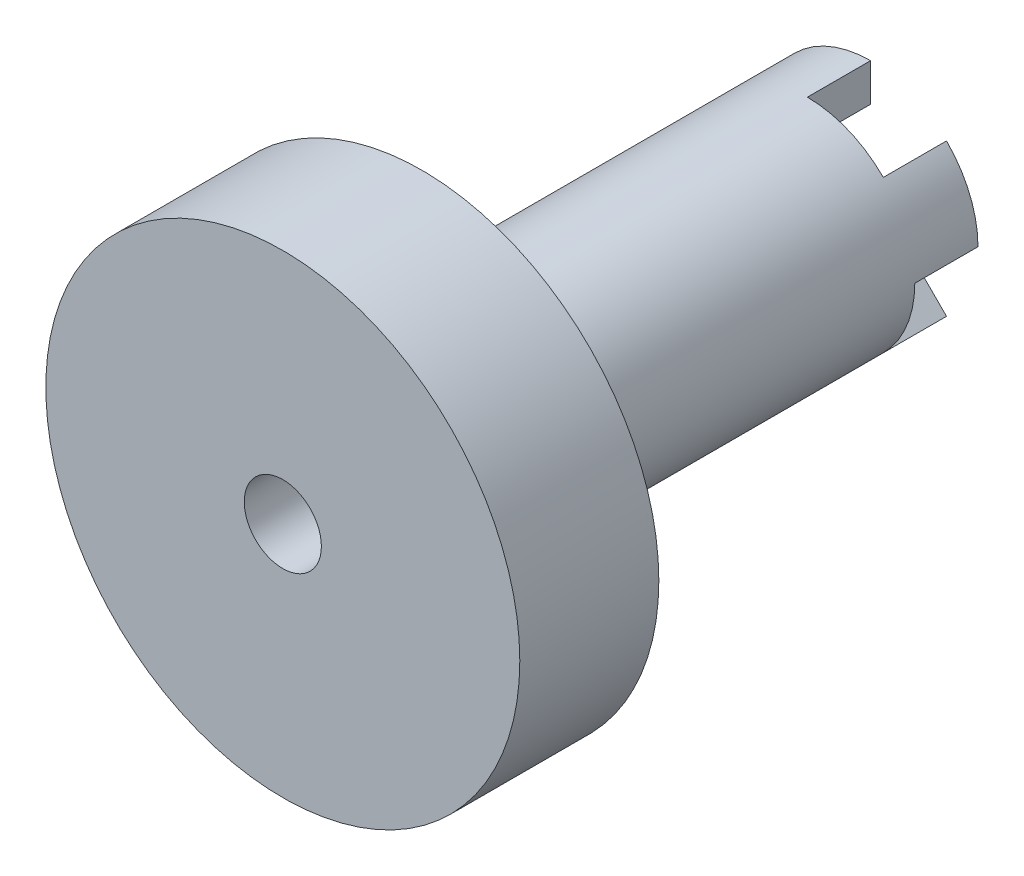
ISO-10303-21;
HEADER;
FILE_DESCRIPTION(('STEP AP214'),'2;1');
FILE_NAME('part.step','',(''),(''),'','','');
FILE_SCHEMA(('AUTOMOTIVE_DESIGN { 1 0 10303 214 1 1 1 1 }'));
ENDSEC;
DATA;
#1=APPLICATION_CONTEXT('core data for automotive mechanical design processes');
#2=APPLICATION_PROTOCOL_DEFINITION('international standard','automotive_design',2000,#1);
#3=PRODUCT_CONTEXT('',#1,'mechanical');
#4=PRODUCT('Part','Part','',(#3));
#5=PRODUCT_RELATED_PRODUCT_CATEGORY('part','',(#4));
#6=PRODUCT_DEFINITION_FORMATION('','',#4);
#7=PRODUCT_DEFINITION_CONTEXT('part definition',#1,'design');
#8=PRODUCT_DEFINITION('design','',#6,#7);
#9=PRODUCT_DEFINITION_SHAPE('','',#8);
#10=(LENGTH_UNIT() NAMED_UNIT(*) SI_UNIT(.MILLI.,.METRE.));
#11=(NAMED_UNIT(*) PLANE_ANGLE_UNIT() SI_UNIT($,.RADIAN.));
#12=(NAMED_UNIT(*) SI_UNIT($,.STERADIAN.) SOLID_ANGLE_UNIT());
#13=UNCERTAINTY_MEASURE_WITH_UNIT(LENGTH_MEASURE(1.E-05),#10,'distance_accuracy_value','');
#14=(GEOMETRIC_REPRESENTATION_CONTEXT(3) GLOBAL_UNCERTAINTY_ASSIGNED_CONTEXT((#13)) GLOBAL_UNIT_ASSIGNED_CONTEXT((#10,
#11,#12)) REPRESENTATION_CONTEXT('',''));
#15=CARTESIAN_POINT('',(0.,0.,0.));
#16=DIRECTION('',(0.,0.,1.));
#17=DIRECTION('',(1.,0.,0.));
#18=AXIS2_PLACEMENT_3D('',#15,#16,#17);
#19=CARTESIAN_POINT('',(0.,0.,-21.082));
#20=DIRECTION('',(0.,0.,1.));
#21=DIRECTION('',(1.,0.,0.));
#22=AXIS2_PLACEMENT_3D('',#19,#20,#21);
#23=PLANE('',#22);
#24=CARTESIAN_POINT('',(0.,0.,-21.082));
#25=DIRECTION('',(0.,0.,1.));
#26=DIRECTION('',(1.,0.,0.));
#27=AXIS2_PLACEMENT_3D('',#24,#25,#26);
#28=CIRCLE('',#27,1.55);
#29=CARTESIAN_POINT('',(1.55,0.,-21.082));
#30=VERTEX_POINT('',#29);
#31=EDGE_CURVE('E193',#30,#30,#28,.T.);
#32=ORIENTED_EDGE('',*,*,#31,.T.);
#33=EDGE_LOOP('',(#32));
#34=FACE_BOUND('',#33,.T.);
#35=DIRECTION('',(0.707106781186551,-0.707106781186544,0.));
#36=VECTOR('',#35,1.);
#37=CARTESIAN_POINT('',(0.,0.,-21.082));
#38=LINE('',#37,#36);
#39=CARTESIAN_POINT('',(1.97989898732234,-1.97989898732232,-21.082));
#40=VERTEX_POINT('',#39);
#41=CARTESIAN_POINT('',(3.05328708116353,-3.0532870811635,-21.082));
#42=VERTEX_POINT('',#41);
#43=EDGE_CURVE('E190',#40,#42,#38,.T.);
#44=ORIENTED_EDGE('',*,*,#43,.F.);
#45=CARTESIAN_POINT('',(0.,0.,-21.082));
#46=DIRECTION('',(0.,0.,-1.));
#47=DIRECTION('',(-1.,0.,0.));
#48=AXIS2_PLACEMENT_3D('',#45,#46,#47);
#49=CIRCLE('',#48,2.8);
#50=CARTESIAN_POINT('',(0.,-2.8,-21.082));
#51=VERTEX_POINT('',#50);
#52=EDGE_CURVE('E169',#40,#51,#49,.T.);
#53=ORIENTED_EDGE('',*,*,#52,.T.);
#54=DIRECTION('',(0.,1.,0.));
#55=VECTOR('',#54,1.);
#56=CARTESIAN_POINT('',(0.,0.,-21.082));
#57=LINE('',#56,#55);
#58=CARTESIAN_POINT('',(0.,-4.318,-21.082));
#59=VERTEX_POINT('',#58);
#60=EDGE_CURVE('E186',#59,#51,#57,.T.);
#61=ORIENTED_EDGE('',*,*,#60,.F.);
#62=CARTESIAN_POINT('',(0.,0.,-21.082));
#63=DIRECTION('',(0.,0.,1.));
#64=DIRECTION('',(1.,0.,0.));
#65=AXIS2_PLACEMENT_3D('',#62,#63,#64);
#66=CIRCLE('',#65,4.318);
#67=CARTESIAN_POINT('',(-3.05328708116351,-3.05328708116352,-21.082));
#68=VERTEX_POINT('',#67);
#69=EDGE_CURVE('E448',#68,#59,#66,.T.);
#70=ORIENTED_EDGE('',*,*,#69,.F.);
#71=DIRECTION('',(-0.707106781186546,-0.707106781186549,0.));
#72=VECTOR('',#71,1.);
#73=CARTESIAN_POINT('',(0.,0.,-21.082));
#74=LINE('',#73,#72);
#75=CARTESIAN_POINT('',(-1.97989898732233,-1.97989898732234,-21.082));
#76=VERTEX_POINT('',#75);
#77=EDGE_CURVE('E231',#76,#68,#74,.T.);
#78=ORIENTED_EDGE('',*,*,#77,.F.);
#79=CARTESIAN_POINT('',(0.,0.,-21.082));
#80=DIRECTION('',(0.,0.,-1.));
#81=DIRECTION('',(-1.,0.,0.));
#82=AXIS2_PLACEMENT_3D('',#79,#80,#81);
#83=CIRCLE('',#82,2.8);
#84=CARTESIAN_POINT('',(-2.8,0.,-21.082));
#85=VERTEX_POINT('',#84);
#86=EDGE_CURVE('E173',#76,#85,#83,.T.);
#87=ORIENTED_EDGE('',*,*,#86,.T.);
#88=DIRECTION('',(-1.,0.,0.));
#89=VECTOR('',#88,1.);
#90=CARTESIAN_POINT('',(0.,0.,-21.082));
#91=LINE('',#90,#89);
#92=CARTESIAN_POINT('',(-4.318,0.,-21.082));
#93=VERTEX_POINT('',#92);
#94=EDGE_CURVE('E217',#85,#93,#91,.T.);
#95=ORIENTED_EDGE('',*,*,#94,.T.);
#96=CARTESIAN_POINT('',(-3.05328708116353,3.0532870811635,-21.082));
#97=VERTEX_POINT('',#96);
#98=EDGE_CURVE('E55',#97,#93,#66,.T.);
#99=ORIENTED_EDGE('',*,*,#98,.F.);
#100=DIRECTION('',(0.707106781186551,-0.707106781186544,0.));
#101=VECTOR('',#100,1.);
#102=CARTESIAN_POINT('',(0.,0.,-21.082));
#103=LINE('',#102,#101);
#104=CARTESIAN_POINT('',(-1.97989898732234,1.97989898732232,-21.082));
#105=VERTEX_POINT('',#104);
#106=EDGE_CURVE('E268',#97,#105,#103,.T.);
#107=ORIENTED_EDGE('',*,*,#106,.T.);
#108=CARTESIAN_POINT('',(0.,0.,-21.082));
#109=DIRECTION('',(0.,0.,-1.));
#110=DIRECTION('',(-1.,0.,0.));
#111=AXIS2_PLACEMENT_3D('',#108,#109,#110);
#112=CIRCLE('',#111,2.8);
#113=CARTESIAN_POINT('',(0.,2.8,-21.082));
#114=VERTEX_POINT('',#113);
#115=EDGE_CURVE('E247',#105,#114,#112,.T.);
#116=ORIENTED_EDGE('',*,*,#115,.T.);
#117=DIRECTION('',(0.,1.,0.));
#118=VECTOR('',#117,1.);
#119=CARTESIAN_POINT('',(0.,0.,-21.082));
#120=LINE('',#119,#118);
#121=CARTESIAN_POINT('',(0.,4.318,-21.082));
#122=VERTEX_POINT('',#121);
#123=EDGE_CURVE('E253',#114,#122,#120,.T.);
#124=ORIENTED_EDGE('',*,*,#123,.T.);
#125=CARTESIAN_POINT('',(3.05328708116351,3.05328708116352,-21.082));
#126=VERTEX_POINT('',#125);
#127=EDGE_CURVE('E11',#126,#122,#66,.T.);
#128=ORIENTED_EDGE('',*,*,#127,.F.);
#129=DIRECTION('',(-0.707106781186546,-0.707106781186549,0.));
#130=VECTOR('',#129,1.);
#131=CARTESIAN_POINT('',(0.,0.,-21.082));
#132=LINE('',#131,#130);
#133=CARTESIAN_POINT('',(1.97989898732233,1.97989898732234,-21.082));
#134=VERTEX_POINT('',#133);
#135=EDGE_CURVE('E307',#126,#134,#132,.T.);
#136=ORIENTED_EDGE('',*,*,#135,.T.);
#137=CARTESIAN_POINT('',(0.,0.,-21.082));
#138=DIRECTION('',(0.,0.,-1.));
#139=DIRECTION('',(-1.,0.,0.));
#140=AXIS2_PLACEMENT_3D('',#137,#138,#139);
#141=CIRCLE('',#140,2.8);
#142=CARTESIAN_POINT('',(2.8,0.,-21.082));
#143=VERTEX_POINT('',#142);
#144=EDGE_CURVE('E287',#134,#143,#141,.T.);
#145=ORIENTED_EDGE('',*,*,#144,.T.);
#146=DIRECTION('',(-1.,0.,0.));
#147=VECTOR('',#146,1.);
#148=CARTESIAN_POINT('',(0.,0.,-21.082));
#149=LINE('',#148,#147);
#150=CARTESIAN_POINT('',(4.318,0.,-21.082));
#151=VERTEX_POINT('',#150);
#152=EDGE_CURVE('E293',#151,#143,#149,.T.);
#153=ORIENTED_EDGE('',*,*,#152,.F.);
#154=EDGE_CURVE('E56',#42,#151,#66,.T.);
#155=ORIENTED_EDGE('',*,*,#154,.F.);
#156=EDGE_LOOP('',(#44,#53,#61,#70,#78,#87,#95,#99,#107,#116,#124,#128,#136,#145,#153,#155));
#157=FACE_BOUND('',#156,.T.);
#158=ADVANCED_FACE('F45',(#34,#157),#23,.F.);
#159=CARTESIAN_POINT('',(0.,0.,-21.082));
#160=DIRECTION('',(0.,0.,1.));
#161=DIRECTION('',(1.,0.,0.));
#162=AXIS2_PLACEMENT_3D('',#159,#160,#161);
#163=CYLINDRICAL_SURFACE('',#162,4.318);
#164=ORIENTED_EDGE('',*,*,#127,.T.);
#165=DIRECTION('',(0.,0.,1.));
#166=VECTOR('',#165,1.);
#167=CARTESIAN_POINT('',(0.,4.318,-23.622));
#168=LINE('',#167,#166);
#169=CARTESIAN_POINT('',(0.,4.318,-23.622));
#170=VERTEX_POINT('',#169);
#171=EDGE_CURVE('E277',#170,#122,#168,.T.);
#172=ORIENTED_EDGE('',*,*,#171,.F.);
#173=CARTESIAN_POINT('',(0.,0.,-23.622));
#174=DIRECTION('',(0.,0.,-1.));
#175=DIRECTION('',(-1.,0.,0.));
#176=AXIS2_PLACEMENT_3D('',#173,#174,#175);
#177=CIRCLE('',#176,4.318);
#178=CARTESIAN_POINT('',(-3.05328708116353,3.0532870811635,-23.622));
#179=VERTEX_POINT('',#178);
#180=EDGE_CURVE('E257',#179,#170,#177,.T.);
#181=ORIENTED_EDGE('',*,*,#180,.F.);
#182=DIRECTION('',(0.,0.,1.));
#183=VECTOR('',#182,1.);
#184=CARTESIAN_POINT('',(-3.05328708116353,3.0532870811635,-23.622));
#185=LINE('',#184,#183);
#186=EDGE_CURVE('E280',#179,#97,#185,.T.);
#187=ORIENTED_EDGE('',*,*,#186,.T.);
#188=ORIENTED_EDGE('',*,*,#98,.T.);
#189=DIRECTION('',(0.,0.,1.));
#190=VECTOR('',#189,1.);
#191=CARTESIAN_POINT('',(-4.318,0.,-23.622));
#192=LINE('',#191,#190);
#193=CARTESIAN_POINT('',(-4.318,0.,-23.622));
#194=VERTEX_POINT('',#193);
#195=EDGE_CURVE('E239',#194,#93,#192,.T.);
#196=ORIENTED_EDGE('',*,*,#195,.F.);
#197=CARTESIAN_POINT('',(0.,0.,-23.622));
#198=DIRECTION('',(0.,0.,-1.));
#199=DIRECTION('',(-1.,0.,0.));
#200=AXIS2_PLACEMENT_3D('',#197,#198,#199);
#201=CIRCLE('',#200,4.318);
#202=CARTESIAN_POINT('',(-3.05328708116351,-3.05328708116352,-23.622));
#203=VERTEX_POINT('',#202);
#204=EDGE_CURVE('E220',#203,#194,#201,.T.);
#205=ORIENTED_EDGE('',*,*,#204,.F.);
#206=DIRECTION('',(0.,0.,1.));
#207=VECTOR('',#206,1.);
#208=CARTESIAN_POINT('',(-3.05328708116351,-3.05328708116352,-23.622));
#209=LINE('',#208,#207);
#210=EDGE_CURVE('E70',#203,#68,#209,.T.);
#211=ORIENTED_EDGE('',*,*,#210,.T.);
#212=ORIENTED_EDGE('',*,*,#69,.T.);
#213=DIRECTION('',(0.,0.,1.));
#214=VECTOR('',#213,1.);
#215=CARTESIAN_POINT('',(0.,-4.318,-23.622));
#216=LINE('',#215,#214);
#217=CARTESIAN_POINT('',(0.,-4.318,-23.622));
#218=VERTEX_POINT('',#217);
#219=EDGE_CURVE('E207',#218,#59,#216,.T.);
#220=ORIENTED_EDGE('',*,*,#219,.F.);
#221=CARTESIAN_POINT('',(0.,0.,-23.622));
#222=DIRECTION('',(0.,0.,-1.));
#223=DIRECTION('',(-1.,0.,0.));
#224=AXIS2_PLACEMENT_3D('',#221,#222,#223);
#225=CIRCLE('',#224,4.318);
#226=CARTESIAN_POINT('',(3.05328708116353,-3.0532870811635,-23.622));
#227=VERTEX_POINT('',#226);
#228=EDGE_CURVE('E179',#227,#218,#225,.T.);
#229=ORIENTED_EDGE('',*,*,#228,.F.);
#230=DIRECTION('',(0.,0.,1.));
#231=VECTOR('',#230,1.);
#232=CARTESIAN_POINT('',(3.05328708116353,-3.0532870811635,-23.622));
#233=LINE('',#232,#231);
#234=EDGE_CURVE('E63',#227,#42,#233,.T.);
#235=ORIENTED_EDGE('',*,*,#234,.T.);
#236=ORIENTED_EDGE('',*,*,#154,.T.);
#237=DIRECTION('',(0.,0.,1.));
#238=VECTOR('',#237,1.);
#239=CARTESIAN_POINT('',(4.318,0.,-23.622));
#240=LINE('',#239,#238);
#241=CARTESIAN_POINT('',(4.318,0.,-23.622));
#242=VERTEX_POINT('',#241);
#243=EDGE_CURVE('E316',#242,#151,#240,.T.);
#244=ORIENTED_EDGE('',*,*,#243,.F.);
#245=CARTESIAN_POINT('',(0.,0.,-23.622));
#246=DIRECTION('',(0.,0.,-1.));
#247=DIRECTION('',(-1.,0.,0.));
#248=AXIS2_PLACEMENT_3D('',#245,#246,#247);
#249=CIRCLE('',#248,4.318);
#250=CARTESIAN_POINT('',(3.05328708116351,3.05328708116352,-23.622));
#251=VERTEX_POINT('',#250);
#252=EDGE_CURVE('E297',#251,#242,#249,.T.);
#253=ORIENTED_EDGE('',*,*,#252,.F.);
#254=DIRECTION('',(0.,0.,1.));
#255=VECTOR('',#254,1.);
#256=CARTESIAN_POINT('',(3.05328708116351,3.05328708116352,-23.622));
#257=LINE('',#256,#255);
#258=EDGE_CURVE('E320',#251,#126,#257,.T.);
#259=ORIENTED_EDGE('',*,*,#258,.T.);
#260=EDGE_LOOP('',(#164,#172,#181,#187,#188,#196,#205,#211,#212,#220,#229,#235,#236,#244,#253,#259));
#261=FACE_BOUND('',#260,.T.);
#262=CARTESIAN_POINT('',(0.,0.,-5.588));
#263=DIRECTION('',(0.,0.,1.));
#264=DIRECTION('',(1.,0.,0.));
#265=AXIS2_PLACEMENT_3D('',#262,#263,#264);
#266=CIRCLE('',#265,4.318);
#267=CARTESIAN_POINT('',(4.318,0.,-5.588));
#268=VERTEX_POINT('',#267);
#269=EDGE_CURVE('E49',#268,#268,#266,.F.);
#270=ORIENTED_EDGE('',*,*,#269,.T.);
#271=EDGE_LOOP('',(#270));
#272=FACE_BOUND('',#271,.T.);
#273=ADVANCED_FACE('F47',(#261,#272),#163,.T.);
#274=CARTESIAN_POINT('',(0.,0.,-5.588));
#275=DIRECTION('',(0.,0.,1.));
#276=DIRECTION('',(1.,0.,0.));
#277=AXIS2_PLACEMENT_3D('',#274,#275,#276);
#278=CYLINDRICAL_SURFACE('',#277,9.525);
#279=CARTESIAN_POINT('',(0.,0.,-5.588));
#280=DIRECTION('',(0.,0.,1.));
#281=DIRECTION('',(1.,0.,0.));
#282=AXIS2_PLACEMENT_3D('',#279,#280,#281);
#283=CIRCLE('',#282,9.525);
#284=CARTESIAN_POINT('',(9.525,0.,-5.588));
#285=VERTEX_POINT('',#284);
#286=EDGE_CURVE('E328',#285,#285,#283,.T.);
#287=ORIENTED_EDGE('',*,*,#286,.T.);
#288=EDGE_LOOP('',(#287));
#289=FACE_BOUND('',#288,.T.);
#290=CARTESIAN_POINT('',(0.,0.,0.));
#291=DIRECTION('',(0.,0.,1.));
#292=DIRECTION('',(1.,0.,0.));
#293=AXIS2_PLACEMENT_3D('',#290,#291,#292);
#294=CIRCLE('',#293,9.525);
#295=CARTESIAN_POINT('',(9.525,0.,0.));
#296=VERTEX_POINT('',#295);
#297=EDGE_CURVE('E327',#296,#296,#294,.T.);
#298=ORIENTED_EDGE('',*,*,#297,.F.);
#299=EDGE_LOOP('',(#298));
#300=FACE_BOUND('',#299,.T.);
#301=ADVANCED_FACE('F338',(#289,#300),#278,.T.);
#302=CARTESIAN_POINT('',(0.,0.,-5.588));
#303=DIRECTION('',(0.,0.,1.));
#304=DIRECTION('',(1.,0.,0.));
#305=AXIS2_PLACEMENT_3D('',#302,#303,#304);
#306=PLANE('',#305);
#307=ORIENTED_EDGE('',*,*,#269,.F.);
#308=EDGE_LOOP('',(#307));
#309=FACE_BOUND('',#308,.T.);
#310=ORIENTED_EDGE('',*,*,#286,.F.);
#311=EDGE_LOOP('',(#310));
#312=FACE_BOUND('',#311,.T.);
#313=ADVANCED_FACE('F340',(#309,#312),#306,.F.);
#314=CARTESIAN_POINT('',(0.,0.,0.));
#315=DIRECTION('',(0.,0.,1.));
#316=DIRECTION('',(1.,0.,0.));
#317=AXIS2_PLACEMENT_3D('',#314,#315,#316);
#318=PLANE('',#317);
#319=CARTESIAN_POINT('',(0.,0.,0.));
#320=DIRECTION('',(0.,0.,1.));
#321=DIRECTION('',(1.,0.,0.));
#322=AXIS2_PLACEMENT_3D('',#319,#320,#321);
#323=CIRCLE('',#322,1.55);
#324=CARTESIAN_POINT('',(1.55,0.,0.));
#325=VERTEX_POINT('',#324);
#326=EDGE_CURVE('E369',#325,#325,#323,.T.);
#327=ORIENTED_EDGE('',*,*,#326,.F.);
#328=EDGE_LOOP('',(#327));
#329=FACE_BOUND('',#328,.T.);
#330=ORIENTED_EDGE('',*,*,#297,.T.);
#331=EDGE_LOOP('',(#330));
#332=FACE_BOUND('',#331,.T.);
#333=ADVANCED_FACE('F336',(#329,#332),#318,.T.);
#334=CARTESIAN_POINT('',(0.,0.,-23.622));
#335=DIRECTION('',(0.,0.,1.));
#336=DIRECTION('',(1.,0.,0.));
#337=AXIS2_PLACEMENT_3D('',#334,#335,#336);
#338=CYLINDRICAL_SURFACE('',#337,2.8);
#339=ORIENTED_EDGE('',*,*,#144,.F.);
#340=DIRECTION('',(0.,0.,1.));
#341=VECTOR('',#340,1.);
#342=CARTESIAN_POINT('',(1.97989898732233,1.97989898732234,-23.622));
#343=LINE('',#342,#341);
#344=CARTESIAN_POINT('',(1.97989898732233,1.97989898732234,-23.622));
#345=VERTEX_POINT('',#344);
#346=EDGE_CURVE('E323',#345,#134,#343,.T.);
#347=ORIENTED_EDGE('',*,*,#346,.F.);
#348=CARTESIAN_POINT('',(0.,0.,-23.622));
#349=DIRECTION('',(0.,0.,-1.));
#350=DIRECTION('',(-1.,0.,0.));
#351=AXIS2_PLACEMENT_3D('',#348,#349,#350);
#352=CIRCLE('',#351,2.8);
#353=CARTESIAN_POINT('',(2.8,0.,-23.622));
#354=VERTEX_POINT('',#353);
#355=EDGE_CURVE('E288',#345,#354,#352,.T.);
#356=ORIENTED_EDGE('',*,*,#355,.T.);
#357=DIRECTION('',(0.,0.,1.));
#358=VECTOR('',#357,1.);
#359=CARTESIAN_POINT('',(2.8,0.,-23.622));
#360=LINE('',#359,#358);
#361=EDGE_CURVE('E303',#354,#143,#360,.T.);
#362=ORIENTED_EDGE('',*,*,#361,.T.);
#363=EDGE_LOOP('',(#339,#347,#356,#362));
#364=FACE_BOUND('',#363,.T.);
#365=ADVANCED_FACE('F358',(#364),#338,.F.);
#366=CARTESIAN_POINT('',(0.,0.,-23.622));
#367=DIRECTION('',(-0.707106781186549,0.707106781186546,0.));
#368=DIRECTION('',(-0.707106781186546,-0.707106781186549,0.));
#369=AXIS2_PLACEMENT_3D('',#366,#367,#368);
#370=PLANE('',#369);
#371=ORIENTED_EDGE('',*,*,#135,.F.);
#372=ORIENTED_EDGE('',*,*,#258,.F.);
#373=DIRECTION('',(-0.707106781186546,-0.707106781186549,0.));
#374=VECTOR('',#373,1.);
#375=CARTESIAN_POINT('',(0.,0.,-23.622));
#376=LINE('',#375,#374);
#377=EDGE_CURVE('E292',#251,#345,#376,.T.);
#378=ORIENTED_EDGE('',*,*,#377,.T.);
#379=ORIENTED_EDGE('',*,*,#346,.T.);
#380=EDGE_LOOP('',(#371,#372,#378,#379));
#381=FACE_BOUND('',#380,.T.);
#382=ADVANCED_FACE('F364',(#381),#370,.T.);
#383=CARTESIAN_POINT('',(0.,0.,-23.622));
#384=DIRECTION('',(0.,1.,0.));
#385=DIRECTION('',(0.,0.,1.));
#386=AXIS2_PLACEMENT_3D('',#383,#384,#385);
#387=PLANE('',#386);
#388=ORIENTED_EDGE('',*,*,#152,.T.);
#389=ORIENTED_EDGE('',*,*,#361,.F.);
#390=DIRECTION('',(-1.,0.,0.));
#391=VECTOR('',#390,1.);
#392=CARTESIAN_POINT('',(0.,0.,-23.622));
#393=LINE('',#392,#391);
#394=EDGE_CURVE('E300',#242,#354,#393,.T.);
#395=ORIENTED_EDGE('',*,*,#394,.F.);
#396=ORIENTED_EDGE('',*,*,#243,.T.);
#397=EDGE_LOOP('',(#388,#389,#395,#396));
#398=FACE_BOUND('',#397,.T.);
#399=ADVANCED_FACE('F424',(#398),#387,.F.);
#400=CARTESIAN_POINT('',(0.,0.,-23.622));
#401=DIRECTION('',(0.,0.,-1.));
#402=DIRECTION('',(-1.,0.,0.));
#403=AXIS2_PLACEMENT_3D('',#400,#401,#402);
#404=PLANE('',#403);
#405=ORIENTED_EDGE('',*,*,#355,.F.);
#406=ORIENTED_EDGE('',*,*,#377,.F.);
#407=ORIENTED_EDGE('',*,*,#252,.T.);
#408=ORIENTED_EDGE('',*,*,#394,.T.);
#409=EDGE_LOOP('',(#405,#406,#407,#408));
#410=FACE_BOUND('',#409,.T.);
#411=ADVANCED_FACE('F420',(#410),#404,.T.);
#412=CARTESIAN_POINT('',(0.,0.,-23.622));
#413=DIRECTION('',(0.,0.,1.));
#414=DIRECTION('',(1.,0.,0.));
#415=AXIS2_PLACEMENT_3D('',#412,#413,#414);
#416=CYLINDRICAL_SURFACE('',#415,2.8);
#417=ORIENTED_EDGE('',*,*,#115,.F.);
#418=DIRECTION('',(0.,0.,1.));
#419=VECTOR('',#418,1.);
#420=CARTESIAN_POINT('',(-1.97989898732234,1.97989898732232,-23.622));
#421=LINE('',#420,#419);
#422=CARTESIAN_POINT('',(-1.97989898732234,1.97989898732232,-23.622));
#423=VERTEX_POINT('',#422);
#424=EDGE_CURVE('E284',#423,#105,#421,.T.);
#425=ORIENTED_EDGE('',*,*,#424,.F.);
#426=CARTESIAN_POINT('',(0.,0.,-23.622));
#427=DIRECTION('',(0.,0.,-1.));
#428=DIRECTION('',(-1.,0.,0.));
#429=AXIS2_PLACEMENT_3D('',#426,#427,#428);
#430=CIRCLE('',#429,2.8);
#431=CARTESIAN_POINT('',(0.,2.8,-23.622));
#432=VERTEX_POINT('',#431);
#433=EDGE_CURVE('E248',#423,#432,#430,.T.);
#434=ORIENTED_EDGE('',*,*,#433,.T.);
#435=DIRECTION('',(0.,0.,1.));
#436=VECTOR('',#435,1.);
#437=CARTESIAN_POINT('',(0.,2.8,-23.622));
#438=LINE('',#437,#436);
#439=EDGE_CURVE('E264',#432,#114,#438,.T.);
#440=ORIENTED_EDGE('',*,*,#439,.T.);
#441=EDGE_LOOP('',(#417,#425,#434,#440));
#442=FACE_BOUND('',#441,.T.);
#443=ADVANCED_FACE('F416',(#442),#416,.F.);
#444=CARTESIAN_POINT('',(0.,0.,-23.622));
#445=DIRECTION('',(-0.707106781186544,-0.707106781186551,0.));
#446=DIRECTION('',(0.707106781186551,-0.707106781186544,0.));
#447=AXIS2_PLACEMENT_3D('',#444,#445,#446);
#448=PLANE('',#447);
#449=ORIENTED_EDGE('',*,*,#106,.F.);
#450=ORIENTED_EDGE('',*,*,#186,.F.);
#451=DIRECTION('',(0.707106781186551,-0.707106781186544,0.));
#452=VECTOR('',#451,1.);
#453=CARTESIAN_POINT('',(0.,0.,-23.622));
#454=LINE('',#453,#452);
#455=EDGE_CURVE('E252',#179,#423,#454,.T.);
#456=ORIENTED_EDGE('',*,*,#455,.T.);
#457=ORIENTED_EDGE('',*,*,#424,.T.);
#458=EDGE_LOOP('',(#449,#450,#456,#457));
#459=FACE_BOUND('',#458,.T.);
#460=ADVANCED_FACE('F412',(#459),#448,.T.);
#461=CARTESIAN_POINT('',(0.,0.,-23.622));
#462=DIRECTION('',(1.,0.,0.));
#463=DIRECTION('',(0.,0.,-1.));
#464=AXIS2_PLACEMENT_3D('',#461,#462,#463);
#465=PLANE('',#464);
#466=ORIENTED_EDGE('',*,*,#123,.F.);
#467=ORIENTED_EDGE('',*,*,#439,.F.);
#468=DIRECTION('',(0.,1.,0.));
#469=VECTOR('',#468,1.);
#470=CARTESIAN_POINT('',(0.,0.,-23.622));
#471=LINE('',#470,#469);
#472=EDGE_CURVE('E260',#432,#170,#471,.T.);
#473=ORIENTED_EDGE('',*,*,#472,.T.);
#474=ORIENTED_EDGE('',*,*,#171,.T.);
#475=EDGE_LOOP('',(#466,#467,#473,#474));
#476=FACE_BOUND('',#475,.T.);
#477=ADVANCED_FACE('F408',(#476),#465,.T.);
#478=CARTESIAN_POINT('',(0.,0.,-23.622));
#479=DIRECTION('',(0.,0.,-1.));
#480=DIRECTION('',(-1.,0.,0.));
#481=AXIS2_PLACEMENT_3D('',#478,#479,#480);
#482=PLANE('',#481);
#483=ORIENTED_EDGE('',*,*,#433,.F.);
#484=ORIENTED_EDGE('',*,*,#455,.F.);
#485=ORIENTED_EDGE('',*,*,#180,.T.);
#486=ORIENTED_EDGE('',*,*,#472,.F.);
#487=EDGE_LOOP('',(#483,#484,#485,#486));
#488=FACE_BOUND('',#487,.T.);
#489=ADVANCED_FACE('F404',(#488),#482,.T.);
#490=CARTESIAN_POINT('',(0.,0.,-23.622));
#491=DIRECTION('',(0.,0.,1.));
#492=DIRECTION('',(1.,0.,0.));
#493=AXIS2_PLACEMENT_3D('',#490,#491,#492);
#494=CYLINDRICAL_SURFACE('',#493,2.8);
#495=ORIENTED_EDGE('',*,*,#86,.F.);
#496=DIRECTION('',(0.,0.,1.));
#497=VECTOR('',#496,1.);
#498=CARTESIAN_POINT('',(-1.97989898732233,-1.97989898732234,-23.622));
#499=LINE('',#498,#497);
#500=CARTESIAN_POINT('',(-1.97989898732233,-1.97989898732234,-23.622));
#501=VERTEX_POINT('',#500);
#502=EDGE_CURVE('E244',#501,#76,#499,.T.);
#503=ORIENTED_EDGE('',*,*,#502,.F.);
#504=CARTESIAN_POINT('',(0.,0.,-23.622));
#505=DIRECTION('',(0.,0.,-1.));
#506=DIRECTION('',(-1.,0.,0.));
#507=AXIS2_PLACEMENT_3D('',#504,#505,#506);
#508=CIRCLE('',#507,2.8);
#509=CARTESIAN_POINT('',(-2.8,0.,-23.622));
#510=VERTEX_POINT('',#509);
#511=EDGE_CURVE('E212',#501,#510,#508,.T.);
#512=ORIENTED_EDGE('',*,*,#511,.T.);
#513=DIRECTION('',(0.,0.,1.));
#514=VECTOR('',#513,1.);
#515=CARTESIAN_POINT('',(-2.8,0.,-23.622));
#516=LINE('',#515,#514);
#517=EDGE_CURVE('E227',#510,#85,#516,.T.);
#518=ORIENTED_EDGE('',*,*,#517,.T.);
#519=EDGE_LOOP('',(#495,#503,#512,#518));
#520=FACE_BOUND('',#519,.T.);
#521=ADVANCED_FACE('F400',(#520),#494,.F.);
#522=CARTESIAN_POINT('',(0.,0.,-23.622));
#523=DIRECTION('',(-0.707106781186549,0.707106781186546,0.));
#524=DIRECTION('',(-0.707106781186546,-0.707106781186549,0.));
#525=AXIS2_PLACEMENT_3D('',#522,#523,#524);
#526=PLANE('',#525);
#527=ORIENTED_EDGE('',*,*,#77,.T.);
#528=ORIENTED_EDGE('',*,*,#210,.F.);
#529=DIRECTION('',(-0.707106781186546,-0.707106781186549,0.));
#530=VECTOR('',#529,1.);
#531=CARTESIAN_POINT('',(0.,0.,-23.622));
#532=LINE('',#531,#530);
#533=EDGE_CURVE('E216',#501,#203,#532,.T.);
#534=ORIENTED_EDGE('',*,*,#533,.F.);
#535=ORIENTED_EDGE('',*,*,#502,.T.);
#536=EDGE_LOOP('',(#527,#528,#534,#535));
#537=FACE_BOUND('',#536,.T.);
#538=ADVANCED_FACE('F396',(#537),#526,.F.);
#539=CARTESIAN_POINT('',(0.,0.,-23.622));
#540=DIRECTION('',(0.,1.,0.));
#541=DIRECTION('',(0.,0.,1.));
#542=AXIS2_PLACEMENT_3D('',#539,#540,#541);
#543=PLANE('',#542);
#544=ORIENTED_EDGE('',*,*,#94,.F.);
#545=ORIENTED_EDGE('',*,*,#517,.F.);
#546=DIRECTION('',(-1.,0.,0.));
#547=VECTOR('',#546,1.);
#548=CARTESIAN_POINT('',(0.,0.,-23.622));
#549=LINE('',#548,#547);
#550=EDGE_CURVE('E223',#510,#194,#549,.T.);
#551=ORIENTED_EDGE('',*,*,#550,.T.);
#552=ORIENTED_EDGE('',*,*,#195,.T.);
#553=EDGE_LOOP('',(#544,#545,#551,#552));
#554=FACE_BOUND('',#553,.T.);
#555=ADVANCED_FACE('F392',(#554),#543,.T.);
#556=CARTESIAN_POINT('',(0.,0.,-23.622));
#557=DIRECTION('',(0.,0.,-1.));
#558=DIRECTION('',(-1.,0.,0.));
#559=AXIS2_PLACEMENT_3D('',#556,#557,#558);
#560=PLANE('',#559);
#561=ORIENTED_EDGE('',*,*,#511,.F.);
#562=ORIENTED_EDGE('',*,*,#533,.T.);
#563=ORIENTED_EDGE('',*,*,#204,.T.);
#564=ORIENTED_EDGE('',*,*,#550,.F.);
#565=EDGE_LOOP('',(#561,#562,#563,#564));
#566=FACE_BOUND('',#565,.T.);
#567=ADVANCED_FACE('F389',(#566),#560,.T.);
#568=CARTESIAN_POINT('',(0.,0.,-23.622));
#569=DIRECTION('',(0.,0.,1.));
#570=DIRECTION('',(1.,0.,0.));
#571=AXIS2_PLACEMENT_3D('',#568,#569,#570);
#572=CYLINDRICAL_SURFACE('',#571,2.8);
#573=ORIENTED_EDGE('',*,*,#52,.F.);
#574=DIRECTION('',(0.,0.,1.));
#575=VECTOR('',#574,1.);
#576=CARTESIAN_POINT('',(1.97989898732234,-1.97989898732232,-23.622));
#577=LINE('',#576,#575);
#578=CARTESIAN_POINT('',(1.97989898732234,-1.97989898732232,-23.622));
#579=VERTEX_POINT('',#578);
#580=EDGE_CURVE('E163',#579,#40,#577,.T.);
#581=ORIENTED_EDGE('',*,*,#580,.F.);
#582=CARTESIAN_POINT('',(0.,0.,-23.622));
#583=DIRECTION('',(0.,0.,-1.));
#584=DIRECTION('',(-1.,0.,0.));
#585=AXIS2_PLACEMENT_3D('',#582,#583,#584);
#586=CIRCLE('',#585,2.8);
#587=CARTESIAN_POINT('',(0.,-2.8,-23.622));
#588=VERTEX_POINT('',#587);
#589=EDGE_CURVE('E167',#579,#588,#586,.T.);
#590=ORIENTED_EDGE('',*,*,#589,.T.);
#591=DIRECTION('',(0.,0.,1.));
#592=VECTOR('',#591,1.);
#593=CARTESIAN_POINT('',(0.,-2.8,-23.622));
#594=LINE('',#593,#592);
#595=EDGE_CURVE('E200',#588,#51,#594,.T.);
#596=ORIENTED_EDGE('',*,*,#595,.T.);
#597=EDGE_LOOP('',(#573,#581,#590,#596));
#598=FACE_BOUND('',#597,.T.);
#599=ADVANCED_FACE('F165',(#598),#572,.F.);
#600=CARTESIAN_POINT('',(0.,0.,-23.622));
#601=DIRECTION('',(-0.707106781186544,-0.707106781186551,0.));
#602=DIRECTION('',(0.707106781186551,-0.707106781186544,0.));
#603=AXIS2_PLACEMENT_3D('',#600,#601,#602);
#604=PLANE('',#603);
#605=ORIENTED_EDGE('',*,*,#43,.T.);
#606=ORIENTED_EDGE('',*,*,#234,.F.);
#607=DIRECTION('',(0.707106781186551,-0.707106781186544,0.));
#608=VECTOR('',#607,1.);
#609=CARTESIAN_POINT('',(0.,0.,-23.622));
#610=LINE('',#609,#608);
#611=EDGE_CURVE('E175',#579,#227,#610,.T.);
#612=ORIENTED_EDGE('',*,*,#611,.F.);
#613=ORIENTED_EDGE('',*,*,#580,.T.);
#614=EDGE_LOOP('',(#605,#606,#612,#613));
#615=FACE_BOUND('',#614,.T.);
#616=ADVANCED_FACE('F176',(#615),#604,.F.);
#617=CARTESIAN_POINT('',(0.,0.,-23.622));
#618=DIRECTION('',(1.,0.,0.));
#619=DIRECTION('',(0.,0.,-1.));
#620=AXIS2_PLACEMENT_3D('',#617,#618,#619);
#621=PLANE('',#620);
#622=ORIENTED_EDGE('',*,*,#60,.T.);
#623=ORIENTED_EDGE('',*,*,#595,.F.);
#624=DIRECTION('',(0.,1.,0.));
#625=VECTOR('',#624,1.);
#626=CARTESIAN_POINT('',(0.,0.,-23.622));
#627=LINE('',#626,#625);
#628=EDGE_CURVE('E183',#218,#588,#627,.T.);
#629=ORIENTED_EDGE('',*,*,#628,.F.);
#630=ORIENTED_EDGE('',*,*,#219,.T.);
#631=EDGE_LOOP('',(#622,#623,#629,#630));
#632=FACE_BOUND('',#631,.T.);
#633=ADVANCED_FACE('F379',(#632),#621,.F.);
#634=CARTESIAN_POINT('',(0.,0.,-23.622));
#635=DIRECTION('',(0.,0.,-1.));
#636=DIRECTION('',(-1.,0.,0.));
#637=AXIS2_PLACEMENT_3D('',#634,#635,#636);
#638=PLANE('',#637);
#639=ORIENTED_EDGE('',*,*,#589,.F.);
#640=ORIENTED_EDGE('',*,*,#611,.T.);
#641=ORIENTED_EDGE('',*,*,#228,.T.);
#642=ORIENTED_EDGE('',*,*,#628,.T.);
#643=EDGE_LOOP('',(#639,#640,#641,#642));
#644=FACE_BOUND('',#643,.T.);
#645=ADVANCED_FACE('F181',(#644),#638,.T.);
#646=CARTESIAN_POINT('',(0.,0.,-23.622));
#647=DIRECTION('',(0.,0.,1.));
#648=DIRECTION('',(1.,0.,0.));
#649=AXIS2_PLACEMENT_3D('',#646,#647,#648);
#650=CYLINDRICAL_SURFACE('',#649,1.55);
#651=ORIENTED_EDGE('',*,*,#326,.T.);
#652=EDGE_LOOP('',(#651));
#653=FACE_BOUND('',#652,.T.);
#654=ORIENTED_EDGE('',*,*,#31,.F.);
#655=EDGE_LOOP('',(#654));
#656=FACE_BOUND('',#655,.T.);
#657=ADVANCED_FACE('F375',(#653,#656),#650,.F.);
#658=CLOSED_SHELL('',(#158,#273,#301,#313,#333,#365,#382,#399,#411,#443,#460,#477,#489,#521,
#538,#555,#567,#599,#616,#633,#645,#657));
#659=MANIFOLD_SOLID_BREP('B2',#658);
#660=ADVANCED_BREP_SHAPE_REPRESENTATION('',(#18,#659),#14);
#661=SHAPE_DEFINITION_REPRESENTATION(#9,#660);
ENDSEC;
END-ISO-10303-21;
